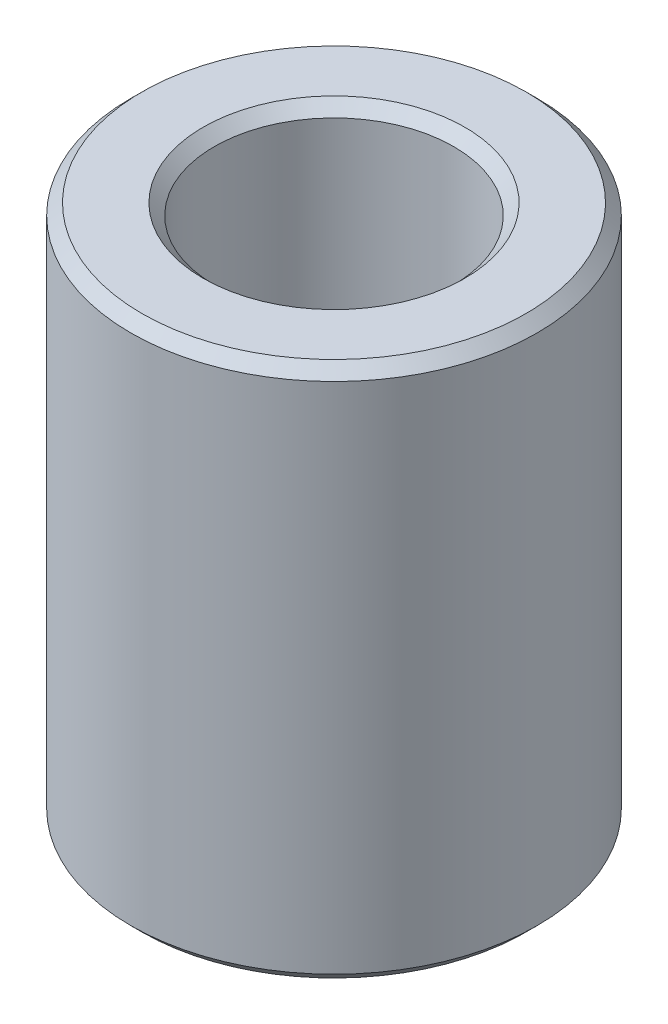
ISO-10303-21;
HEADER;
FILE_DESCRIPTION(('STEP AP214'),'2;1');
FILE_NAME('part.step','',(''),(''),'','','');
FILE_SCHEMA(('AUTOMOTIVE_DESIGN { 1 0 10303 214 1 1 1 1 }'));
ENDSEC;
DATA;
#1=APPLICATION_CONTEXT('core data for automotive mechanical design processes');
#2=APPLICATION_PROTOCOL_DEFINITION('international standard','automotive_design',2000,#1);
#3=PRODUCT_CONTEXT('',#1,'mechanical');
#4=PRODUCT('Part','Part','',(#3));
#5=PRODUCT_RELATED_PRODUCT_CATEGORY('part','',(#4));
#6=PRODUCT_DEFINITION_FORMATION('','',#4);
#7=PRODUCT_DEFINITION_CONTEXT('part definition',#1,'design');
#8=PRODUCT_DEFINITION('design','',#6,#7);
#9=PRODUCT_DEFINITION_SHAPE('','',#8);
#10=(LENGTH_UNIT() NAMED_UNIT(*) SI_UNIT(.MILLI.,.METRE.));
#11=(NAMED_UNIT(*) PLANE_ANGLE_UNIT() SI_UNIT($,.RADIAN.));
#12=(NAMED_UNIT(*) SI_UNIT($,.STERADIAN.) SOLID_ANGLE_UNIT());
#13=UNCERTAINTY_MEASURE_WITH_UNIT(LENGTH_MEASURE(1.E-05),#10,'distance_accuracy_value','');
#14=(GEOMETRIC_REPRESENTATION_CONTEXT(3) GLOBAL_UNCERTAINTY_ASSIGNED_CONTEXT((#13)) GLOBAL_UNIT_ASSIGNED_CONTEXT((#10,
#11,#12)) REPRESENTATION_CONTEXT('',''));
#15=CARTESIAN_POINT('',(0.,0.,0.));
#16=DIRECTION('',(0.,0.,1.));
#17=DIRECTION('',(1.,0.,0.));
#18=AXIS2_PLACEMENT_3D('',#15,#16,#17);
#19=CARTESIAN_POINT('',(0.,98.8560569970589,0.));
#20=DIRECTION('',(0.,-1.,0.));
#21=DIRECTION('',(0.,0.,-1.));
#22=AXIS2_PLACEMENT_3D('',#19,#20,#21);
#23=CYLINDRICAL_SURFACE('',#22,37.5);
#24=CARTESIAN_POINT('',(0.,2.0637683040691,0.));
#25=DIRECTION('',(0.,1.,0.));
#26=DIRECTION('',(0.,0.,1.));
#27=AXIS2_PLACEMENT_3D('',#24,#25,#26);
#28=CIRCLE('',#27,37.5);
#29=CARTESIAN_POINT('',(0.,2.0637683040691,37.5));
#30=VERTEX_POINT('',#29);
#31=EDGE_CURVE('E10',#30,#30,#28,.T.);
#32=ORIENTED_EDGE('',*,*,#31,.T.);
#33=EDGE_LOOP('',(#32));
#34=FACE_BOUND('',#33,.T.);
#35=CARTESIAN_POINT('',(0.,96.7922886929897,0.));
#36=DIRECTION('',(0.,1.,0.));
#37=DIRECTION('',(0.,0.,1.));
#38=AXIS2_PLACEMENT_3D('',#35,#36,#37);
#39=CIRCLE('',#38,37.5);
#40=CARTESIAN_POINT('',(0.,96.7922886929897,37.5));
#41=VERTEX_POINT('',#40);
#42=EDGE_CURVE('E50',#41,#41,#39,.F.);
#43=ORIENTED_EDGE('',*,*,#42,.T.);
#44=EDGE_LOOP('',(#43));
#45=FACE_BOUND('',#44,.T.);
#46=ADVANCED_FACE('F39',(#34,#45),#23,.T.);
#47=CARTESIAN_POINT('',(0.,98.8560569970589,0.));
#48=DIRECTION('',(0.,1.,0.));
#49=DIRECTION('',(0.,0.,1.));
#50=AXIS2_PLACEMENT_3D('',#47,#48,#49);
#51=PLANE('',#50);
#52=CARTESIAN_POINT('',(0.,98.8560569970589,0.));
#53=DIRECTION('',(0.,1.,0.));
#54=DIRECTION('',(0.,0.,1.));
#55=AXIS2_PLACEMENT_3D('',#52,#53,#54);
#56=CIRCLE('',#55,24.1565169275676);
#57=CARTESIAN_POINT('',(0.,98.8560569970589,24.1565169275676));
#58=VERTEX_POINT('',#57);
#59=EDGE_CURVE('E58',#58,#58,#56,.F.);
#60=ORIENTED_EDGE('',*,*,#59,.T.);
#61=EDGE_LOOP('',(#60));
#62=FACE_BOUND('',#61,.T.);
#63=CARTESIAN_POINT('',(0.,98.8560569970589,0.));
#64=DIRECTION('',(0.,1.,0.));
#65=DIRECTION('',(0.,0.,1.));
#66=AXIS2_PLACEMENT_3D('',#63,#64,#65);
#67=CIRCLE('',#66,35.4362316959309);
#68=CARTESIAN_POINT('',(0.,98.8560569970589,35.4362316959309));
#69=VERTEX_POINT('',#68);
#70=EDGE_CURVE('E61',#69,#69,#67,.T.);
#71=ORIENTED_EDGE('',*,*,#70,.T.);
#72=EDGE_LOOP('',(#71));
#73=FACE_BOUND('',#72,.T.);
#74=ADVANCED_FACE('F88',(#62,#73),#51,.T.);
#75=CARTESIAN_POINT('',(0.,0.,0.));
#76=DIRECTION('',(0.,1.,0.));
#77=DIRECTION('',(0.,0.,1.));
#78=AXIS2_PLACEMENT_3D('',#75,#76,#77);
#79=PLANE('',#78);
#80=CARTESIAN_POINT('',(0.,0.,0.));
#81=DIRECTION('',(0.,1.,0.));
#82=DIRECTION('',(0.,0.,1.));
#83=AXIS2_PLACEMENT_3D('',#80,#81,#82);
#84=CIRCLE('',#83,24.1565169275675);
#85=CARTESIAN_POINT('',(0.,0.,24.1565169275675));
#86=VERTEX_POINT('',#85);
#87=EDGE_CURVE('E51',#86,#86,#84,.T.);
#88=ORIENTED_EDGE('',*,*,#87,.T.);
#89=EDGE_LOOP('',(#88));
#90=FACE_BOUND('',#89,.T.);
#91=CARTESIAN_POINT('',(0.,0.,0.));
#92=DIRECTION('',(0.,1.,0.));
#93=DIRECTION('',(0.,0.,1.));
#94=AXIS2_PLACEMENT_3D('',#91,#92,#93);
#95=CIRCLE('',#94,35.4362316959309);
#96=CARTESIAN_POINT('',(0.,0.,35.4362316959309));
#97=VERTEX_POINT('',#96);
#98=EDGE_CURVE('E54',#97,#97,#95,.F.);
#99=ORIENTED_EDGE('',*,*,#98,.T.);
#100=EDGE_LOOP('',(#99));
#101=FACE_BOUND('',#100,.T.);
#102=ADVANCED_FACE('F83',(#90,#101),#79,.F.);
#103=CARTESIAN_POINT('',(0.,98.8560569970589,0.));
#104=DIRECTION('',(0.,-1.,0.));
#105=DIRECTION('',(0.,0.,-1.));
#106=AXIS2_PLACEMENT_3D('',#103,#104,#105);
#107=CYLINDRICAL_SURFACE('',#106,22.0927486234984);
#108=CARTESIAN_POINT('',(0.,96.7922886929898,0.));
#109=DIRECTION('',(0.,1.,0.));
#110=DIRECTION('',(0.,0.,1.));
#111=AXIS2_PLACEMENT_3D('',#108,#109,#110);
#112=CIRCLE('',#111,22.0927486234984);
#113=CARTESIAN_POINT('',(0.,96.7922886929898,22.0927486234984));
#114=VERTEX_POINT('',#113);
#115=EDGE_CURVE('E67',#114,#114,#112,.T.);
#116=ORIENTED_EDGE('',*,*,#115,.T.);
#117=EDGE_LOOP('',(#116));
#118=FACE_BOUND('',#117,.T.);
#119=CARTESIAN_POINT('',(0.,2.06376830406912,0.));
#120=DIRECTION('',(0.,1.,0.));
#121=DIRECTION('',(0.,0.,1.));
#122=AXIS2_PLACEMENT_3D('',#119,#120,#121);
#123=CIRCLE('',#122,22.0927486234984);
#124=CARTESIAN_POINT('',(0.,2.06376830406912,22.0927486234984));
#125=VERTEX_POINT('',#124);
#126=EDGE_CURVE('E69',#125,#125,#123,.F.);
#127=ORIENTED_EDGE('',*,*,#126,.T.);
#128=EDGE_LOOP('',(#127));
#129=FACE_BOUND('',#128,.T.);
#130=ADVANCED_FACE('F71',(#118,#129),#107,.F.);
#131=CARTESIAN_POINT('',(0.,96.7922886929898,0.));
#132=DIRECTION('',(0.,1.,0.));
#133=DIRECTION('',(0.,0.,1.));
#134=AXIS2_PLACEMENT_3D('',#131,#132,#133);
#135=CONICAL_SURFACE('',#134,22.0927486234984,0.78539816339746);
#136=ORIENTED_EDGE('',*,*,#59,.F.);
#137=EDGE_LOOP('',(#136));
#138=FACE_BOUND('',#137,.T.);
#139=ORIENTED_EDGE('',*,*,#115,.F.);
#140=EDGE_LOOP('',(#139));
#141=FACE_BOUND('',#140,.T.);
#142=ADVANCED_FACE('F77',(#138,#141),#135,.F.);
#143=CARTESIAN_POINT('',(0.,0.,0.));
#144=DIRECTION('',(0.,-1.,0.));
#145=DIRECTION('',(0.,0.,-1.));
#146=AXIS2_PLACEMENT_3D('',#143,#144,#145);
#147=CONICAL_SURFACE('',#146,24.1565169275675,0.785398163397443);
#148=ORIENTED_EDGE('',*,*,#126,.F.);
#149=EDGE_LOOP('',(#148));
#150=FACE_BOUND('',#149,.T.);
#151=ORIENTED_EDGE('',*,*,#87,.F.);
#152=EDGE_LOOP('',(#151));
#153=FACE_BOUND('',#152,.T.);
#154=ADVANCED_FACE('F73',(#150,#153),#147,.F.);
#155=CARTESIAN_POINT('',(0.,2.0637683040691,0.));
#156=DIRECTION('',(0.,1.,0.));
#157=DIRECTION('',(0.,0.,1.));
#158=AXIS2_PLACEMENT_3D('',#155,#156,#157);
#159=CONICAL_SURFACE('',#158,37.5,0.785398163397455);
#160=ORIENTED_EDGE('',*,*,#98,.F.);
#161=EDGE_LOOP('',(#160));
#162=FACE_BOUND('',#161,.T.);
#163=ORIENTED_EDGE('',*,*,#31,.F.);
#164=EDGE_LOOP('',(#163));
#165=FACE_BOUND('',#164,.T.);
#166=ADVANCED_FACE('F76',(#162,#165),#159,.T.);
#167=CARTESIAN_POINT('',(0.,98.8560569970589,0.));
#168=DIRECTION('',(0.,-1.,0.));
#169=DIRECTION('',(0.,0.,-1.));
#170=AXIS2_PLACEMENT_3D('',#167,#168,#169);
#171=CONICAL_SURFACE('',#170,35.4362316959309,0.785398163397438);
#172=ORIENTED_EDGE('',*,*,#42,.F.);
#173=EDGE_LOOP('',(#172));
#174=FACE_BOUND('',#173,.T.);
#175=ORIENTED_EDGE('',*,*,#70,.F.);
#176=EDGE_LOOP('',(#175));
#177=FACE_BOUND('',#176,.T.);
#178=ADVANCED_FACE('F45',(#174,#177),#171,.T.);
#179=CLOSED_SHELL('',(#46,#74,#102,#130,#142,#154,#166,#178));
#180=MANIFOLD_SOLID_BREP('B2',#179);
#181=ADVANCED_BREP_SHAPE_REPRESENTATION('',(#18,#180),#14);
#182=SHAPE_DEFINITION_REPRESENTATION(#9,#181);
ENDSEC;
END-ISO-10303-21;
